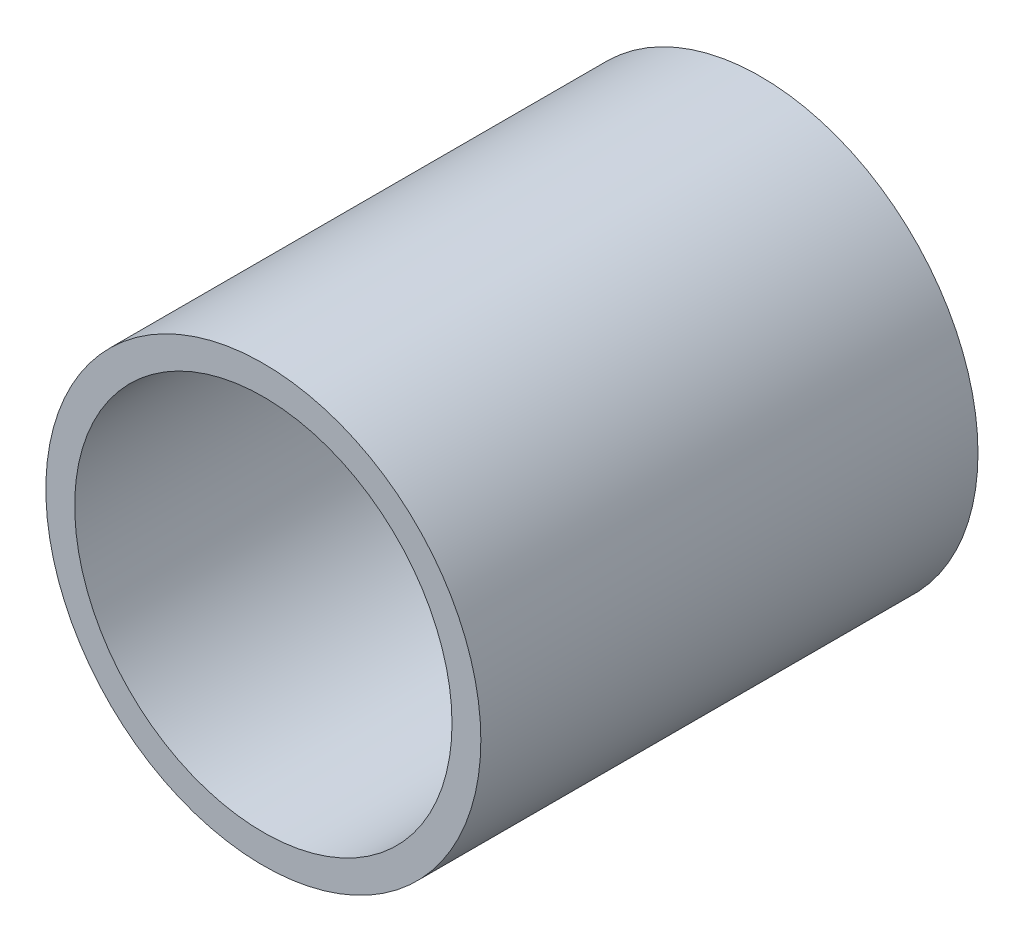
ISO-10303-21;
HEADER;
FILE_DESCRIPTION(('STEP AP214'),'2;1');
FILE_NAME('part.step','',(''),(''),'','','');
FILE_SCHEMA(('AUTOMOTIVE_DESIGN { 1 0 10303 214 1 1 1 1 }'));
ENDSEC;
DATA;
#1=APPLICATION_CONTEXT('core data for automotive mechanical design processes');
#2=APPLICATION_PROTOCOL_DEFINITION('international standard','automotive_design',2000,#1);
#3=PRODUCT_CONTEXT('',#1,'mechanical');
#4=PRODUCT('Part','Part','',(#3));
#5=PRODUCT_RELATED_PRODUCT_CATEGORY('part','',(#4));
#6=PRODUCT_DEFINITION_FORMATION('','',#4);
#7=PRODUCT_DEFINITION_CONTEXT('part definition',#1,'design');
#8=PRODUCT_DEFINITION('design','',#6,#7);
#9=PRODUCT_DEFINITION_SHAPE('','',#8);
#10=(LENGTH_UNIT() NAMED_UNIT(*) SI_UNIT(.MILLI.,.METRE.));
#11=(NAMED_UNIT(*) PLANE_ANGLE_UNIT() SI_UNIT($,.RADIAN.));
#12=(NAMED_UNIT(*) SI_UNIT($,.STERADIAN.) SOLID_ANGLE_UNIT());
#13=UNCERTAINTY_MEASURE_WITH_UNIT(LENGTH_MEASURE(1.E-05),#10,'distance_accuracy_value','');
#14=(GEOMETRIC_REPRESENTATION_CONTEXT(3) GLOBAL_UNCERTAINTY_ASSIGNED_CONTEXT((#13)) GLOBAL_UNIT_ASSIGNED_CONTEXT((#10,
#11,#12)) REPRESENTATION_CONTEXT('',''));
#15=CARTESIAN_POINT('',(0.,0.,0.));
#16=DIRECTION('',(0.,0.,1.));
#17=DIRECTION('',(1.,0.,0.));
#18=AXIS2_PLACEMENT_3D('',#15,#16,#17);
#19=CARTESIAN_POINT('',(0.,0.,12.7));
#20=DIRECTION('',(0.,0.,1.));
#21=DIRECTION('',(1.,0.,0.));
#22=AXIS2_PLACEMENT_3D('',#19,#20,#21);
#23=PLANE('',#22);
#24=CARTESIAN_POINT('',(0.,0.,12.7));
#25=DIRECTION('',(0.,0.,1.));
#26=DIRECTION('',(1.,0.,0.));
#27=AXIS2_PLACEMENT_3D('',#24,#25,#26);
#28=CIRCLE('',#27,11.1125);
#29=CARTESIAN_POINT('',(11.1125,0.,12.7));
#30=VERTEX_POINT('',#29);
#31=EDGE_CURVE('E10',#30,#30,#28,.T.);
#32=ORIENTED_EDGE('',*,*,#31,.T.);
#33=EDGE_LOOP('',(#32));
#34=FACE_BOUND('',#33,.T.);
#35=CARTESIAN_POINT('',(0.,0.,12.7));
#36=DIRECTION('',(0.,0.,1.));
#37=DIRECTION('',(1.,0.,0.));
#38=AXIS2_PLACEMENT_3D('',#35,#36,#37);
#39=CIRCLE('',#38,9.6393);
#40=CARTESIAN_POINT('',(9.6393,0.,12.7));
#41=VERTEX_POINT('',#40);
#42=EDGE_CURVE('E48',#41,#41,#39,.T.);
#43=ORIENTED_EDGE('',*,*,#42,.F.);
#44=EDGE_LOOP('',(#43));
#45=FACE_BOUND('',#44,.T.);
#46=ADVANCED_FACE('F37',(#34,#45),#23,.T.);
#47=CARTESIAN_POINT('',(0.,0.,-12.7));
#48=DIRECTION('',(0.,0.,1.));
#49=DIRECTION('',(1.,0.,0.));
#50=AXIS2_PLACEMENT_3D('',#47,#48,#49);
#51=PLANE('',#50);
#52=CARTESIAN_POINT('',(0.,0.,-12.7));
#53=DIRECTION('',(0.,0.,1.));
#54=DIRECTION('',(1.,0.,0.));
#55=AXIS2_PLACEMENT_3D('',#52,#53,#54);
#56=CIRCLE('',#55,11.1125);
#57=CARTESIAN_POINT('',(11.1125,0.,-12.7));
#58=VERTEX_POINT('',#57);
#59=EDGE_CURVE('E41',#58,#58,#56,.T.);
#60=ORIENTED_EDGE('',*,*,#59,.F.);
#61=EDGE_LOOP('',(#60));
#62=FACE_BOUND('',#61,.T.);
#63=CARTESIAN_POINT('',(0.,0.,-12.7));
#64=DIRECTION('',(0.,0.,1.));
#65=DIRECTION('',(1.,0.,0.));
#66=AXIS2_PLACEMENT_3D('',#63,#64,#65);
#67=CIRCLE('',#66,9.6393);
#68=CARTESIAN_POINT('',(9.6393,0.,-12.7));
#69=VERTEX_POINT('',#68);
#70=EDGE_CURVE('E50',#69,#69,#67,.T.);
#71=ORIENTED_EDGE('',*,*,#70,.T.);
#72=EDGE_LOOP('',(#71));
#73=FACE_BOUND('',#72,.T.);
#74=ADVANCED_FACE('F60',(#62,#73),#51,.F.);
#75=CARTESIAN_POINT('',(0.,0.,12.7));
#76=DIRECTION('',(0.,0.,-1.));
#77=DIRECTION('',(-1.,0.,0.));
#78=AXIS2_PLACEMENT_3D('',#75,#76,#77);
#79=CYLINDRICAL_SURFACE('',#78,11.1125);
#80=ORIENTED_EDGE('',*,*,#31,.F.);
#81=EDGE_LOOP('',(#80));
#82=FACE_BOUND('',#81,.T.);
#83=ORIENTED_EDGE('',*,*,#59,.T.);
#84=EDGE_LOOP('',(#83));
#85=FACE_BOUND('',#84,.T.);
#86=ADVANCED_FACE('F39',(#82,#85),#79,.T.);
#87=CARTESIAN_POINT('',(0.,0.,12.7));
#88=DIRECTION('',(0.,0.,-1.));
#89=DIRECTION('',(-1.,0.,0.));
#90=AXIS2_PLACEMENT_3D('',#87,#88,#89);
#91=CYLINDRICAL_SURFACE('',#90,9.6393);
#92=ORIENTED_EDGE('',*,*,#42,.T.);
#93=EDGE_LOOP('',(#92));
#94=FACE_BOUND('',#93,.T.);
#95=ORIENTED_EDGE('',*,*,#70,.F.);
#96=EDGE_LOOP('',(#95));
#97=FACE_BOUND('',#96,.T.);
#98=ADVANCED_FACE('F56',(#94,#97),#91,.F.);
#99=CLOSED_SHELL('',(#46,#74,#86,#98));
#100=MANIFOLD_SOLID_BREP('B2',#99);
#101=ADVANCED_BREP_SHAPE_REPRESENTATION('',(#18,#100),#14);
#102=SHAPE_DEFINITION_REPRESENTATION(#9,#101);
ENDSEC;
END-ISO-10303-21;
